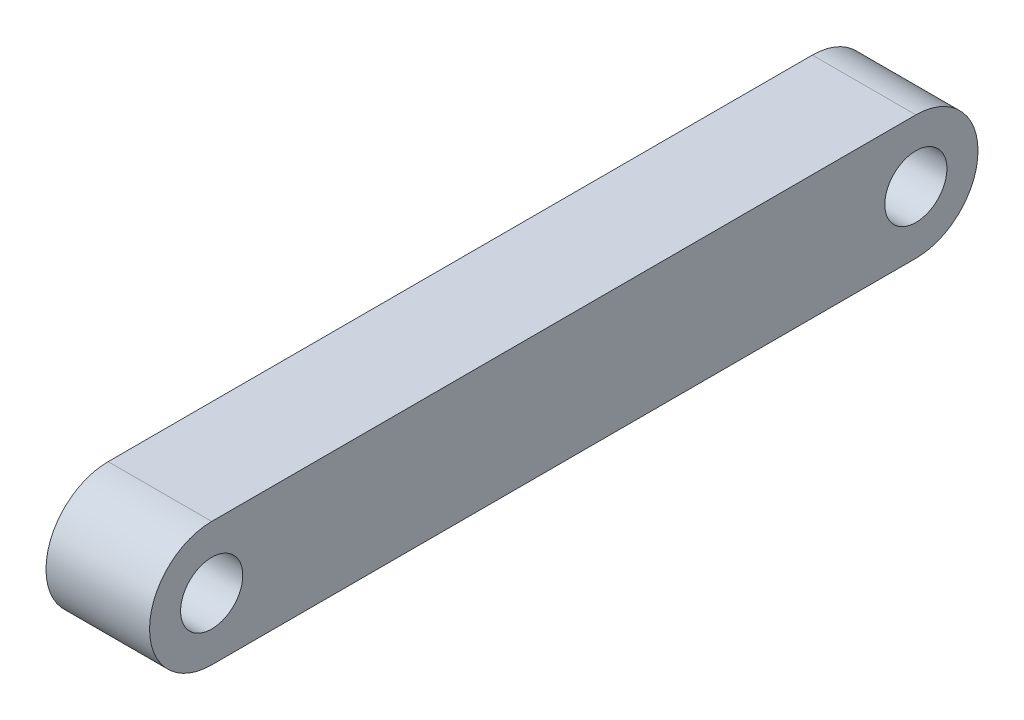
ISO-10303-21;
HEADER;
FILE_DESCRIPTION(('STEP AP214'),'2;1');
FILE_NAME('part.step','',(''),(''),'','','');
FILE_SCHEMA(('AUTOMOTIVE_DESIGN { 1 0 10303 214 1 1 1 1 }'));
ENDSEC;
DATA;
#1=APPLICATION_CONTEXT('core data for automotive mechanical design processes');
#2=APPLICATION_PROTOCOL_DEFINITION('international standard','automotive_design',2000,#1);
#3=PRODUCT_CONTEXT('',#1,'mechanical');
#4=PRODUCT('Part','Part','',(#3));
#5=PRODUCT_RELATED_PRODUCT_CATEGORY('part','',(#4));
#6=PRODUCT_DEFINITION_FORMATION('','',#4);
#7=PRODUCT_DEFINITION_CONTEXT('part definition',#1,'design');
#8=PRODUCT_DEFINITION('design','',#6,#7);
#9=PRODUCT_DEFINITION_SHAPE('','',#8);
#10=(LENGTH_UNIT() NAMED_UNIT(*) SI_UNIT(.MILLI.,.METRE.));
#11=(NAMED_UNIT(*) PLANE_ANGLE_UNIT() SI_UNIT($,.RADIAN.));
#12=(NAMED_UNIT(*) SI_UNIT($,.STERADIAN.) SOLID_ANGLE_UNIT());
#13=UNCERTAINTY_MEASURE_WITH_UNIT(LENGTH_MEASURE(1.E-05),#10,'distance_accuracy_value','');
#14=(GEOMETRIC_REPRESENTATION_CONTEXT(3) GLOBAL_UNCERTAINTY_ASSIGNED_CONTEXT((#13)) GLOBAL_UNIT_ASSIGNED_CONTEXT((#10,
#11,#12)) REPRESENTATION_CONTEXT('',''));
#15=CARTESIAN_POINT('',(0.,0.,0.));
#16=DIRECTION('',(0.,0.,1.));
#17=DIRECTION('',(1.,0.,0.));
#18=AXIS2_PLACEMENT_3D('',#15,#16,#17);
#19=CARTESIAN_POINT('',(2.5,0.,17.));
#20=DIRECTION('',(1.,0.,0.));
#21=DIRECTION('',(0.,0.,-1.));
#22=AXIS2_PLACEMENT_3D('',#19,#20,#21);
#23=PLANE('',#22);
#24=CARTESIAN_POINT('',(2.5,0.,-17.));
#25=DIRECTION('',(1.,0.,0.));
#26=DIRECTION('',(0.,0.,-1.));
#27=AXIS2_PLACEMENT_3D('',#24,#25,#26);
#28=CIRCLE('',#27,1.5);
#29=CARTESIAN_POINT('',(2.5,0.,-18.5));
#30=VERTEX_POINT('',#29);
#31=EDGE_CURVE('E106',#30,#30,#28,.T.);
#32=ORIENTED_EDGE('',*,*,#31,.F.);
#33=EDGE_LOOP('',(#32));
#34=FACE_BOUND('',#33,.T.);
#35=CARTESIAN_POINT('',(2.5,0.,17.));
#36=DIRECTION('',(1.,0.,0.));
#37=DIRECTION('',(0.,0.,-1.));
#38=AXIS2_PLACEMENT_3D('',#35,#36,#37);
#39=CIRCLE('',#38,3.00000000000001);
#40=CARTESIAN_POINT('',(2.5,3.00000000000001,17.));
#41=VERTEX_POINT('',#40);
#42=CARTESIAN_POINT('',(2.5,-3.00000000000001,17.));
#43=VERTEX_POINT('',#42);
#44=EDGE_CURVE('E91',#41,#43,#39,.T.);
#45=ORIENTED_EDGE('',*,*,#44,.T.);
#46=DIRECTION('',(0.,0.,-1.));
#47=VECTOR('',#46,1.);
#48=CARTESIAN_POINT('',(2.5,-3.00000000000001,17.));
#49=LINE('',#48,#47);
#50=CARTESIAN_POINT('',(2.5,-3.00000000000001,-17.));
#51=VERTEX_POINT('',#50);
#52=EDGE_CURVE('E86',#43,#51,#49,.T.);
#53=ORIENTED_EDGE('',*,*,#52,.T.);
#54=CARTESIAN_POINT('',(2.5,0.,-17.));
#55=DIRECTION('',(1.,0.,0.));
#56=DIRECTION('',(0.,0.,-1.));
#57=AXIS2_PLACEMENT_3D('',#54,#55,#56);
#58=CIRCLE('',#57,3.00000000000001);
#59=CARTESIAN_POINT('',(2.5,3.00000000000001,-17.));
#60=VERTEX_POINT('',#59);
#61=EDGE_CURVE('E89',#51,#60,#58,.T.);
#62=ORIENTED_EDGE('',*,*,#61,.T.);
#63=DIRECTION('',(0.,0.,1.));
#64=VECTOR('',#63,1.);
#65=CARTESIAN_POINT('',(2.5,3.00000000000001,17.));
#66=LINE('',#65,#64);
#67=EDGE_CURVE('E56',#60,#41,#66,.T.);
#68=ORIENTED_EDGE('',*,*,#67,.T.);
#69=EDGE_LOOP('',(#45,#53,#62,#68));
#70=FACE_BOUND('',#69,.T.);
#71=CARTESIAN_POINT('',(2.5,0.,17.));
#72=DIRECTION('',(1.,0.,0.));
#73=DIRECTION('',(0.,0.,-1.));
#74=AXIS2_PLACEMENT_3D('',#71,#72,#73);
#75=CIRCLE('',#74,1.5);
#76=CARTESIAN_POINT('',(2.5,0.,15.5));
#77=VERTEX_POINT('',#76);
#78=EDGE_CURVE('E121',#77,#77,#75,.T.);
#79=ORIENTED_EDGE('',*,*,#78,.F.);
#80=EDGE_LOOP('',(#79));
#81=FACE_BOUND('',#80,.T.);
#82=ADVANCED_FACE('F39',(#34,#70,#81),#23,.T.);
#83=CARTESIAN_POINT('',(-2.5,0.,17.));
#84=DIRECTION('',(1.,0.,0.));
#85=DIRECTION('',(0.,0.,-1.));
#86=AXIS2_PLACEMENT_3D('',#83,#84,#85);
#87=PLANE('',#86);
#88=CARTESIAN_POINT('',(-2.5,0.,17.));
#89=DIRECTION('',(1.,0.,0.));
#90=DIRECTION('',(0.,0.,-1.));
#91=AXIS2_PLACEMENT_3D('',#88,#89,#90);
#92=CIRCLE('',#91,3.00000000000001);
#93=CARTESIAN_POINT('',(-2.5,3.00000000000001,17.));
#94=VERTEX_POINT('',#93);
#95=CARTESIAN_POINT('',(-2.5,-3.00000000000001,17.));
#96=VERTEX_POINT('',#95);
#97=EDGE_CURVE('E103',#94,#96,#92,.T.);
#98=ORIENTED_EDGE('',*,*,#97,.F.);
#99=DIRECTION('',(0.,0.,1.));
#100=VECTOR('',#99,1.);
#101=CARTESIAN_POINT('',(-2.5,3.00000000000001,17.));
#102=LINE('',#101,#100);
#103=CARTESIAN_POINT('',(-2.5,3.00000000000001,-17.));
#104=VERTEX_POINT('',#103);
#105=EDGE_CURVE('E79',#104,#94,#102,.T.);
#106=ORIENTED_EDGE('',*,*,#105,.F.);
#107=CARTESIAN_POINT('',(-2.5,0.,-17.));
#108=DIRECTION('',(1.,0.,0.));
#109=DIRECTION('',(0.,0.,-1.));
#110=AXIS2_PLACEMENT_3D('',#107,#108,#109);
#111=CIRCLE('',#110,3.00000000000001);
#112=CARTESIAN_POINT('',(-2.5,-3.00000000000001,-17.));
#113=VERTEX_POINT('',#112);
#114=EDGE_CURVE('E73',#113,#104,#111,.T.);
#115=ORIENTED_EDGE('',*,*,#114,.F.);
#116=DIRECTION('',(0.,0.,-1.));
#117=VECTOR('',#116,1.);
#118=CARTESIAN_POINT('',(-2.5,-3.00000000000001,17.));
#119=LINE('',#118,#117);
#120=EDGE_CURVE('E95',#96,#113,#119,.T.);
#121=ORIENTED_EDGE('',*,*,#120,.F.);
#122=EDGE_LOOP('',(#98,#106,#115,#121));
#123=FACE_BOUND('',#122,.T.);
#124=CARTESIAN_POINT('',(-2.5,0.,-17.));
#125=DIRECTION('',(1.,0.,0.));
#126=DIRECTION('',(0.,0.,-1.));
#127=AXIS2_PLACEMENT_3D('',#124,#125,#126);
#128=CIRCLE('',#127,1.5);
#129=CARTESIAN_POINT('',(-2.5,0.,-18.5));
#130=VERTEX_POINT('',#129);
#131=EDGE_CURVE('E118',#130,#130,#128,.T.);
#132=ORIENTED_EDGE('',*,*,#131,.T.);
#133=EDGE_LOOP('',(#132));
#134=FACE_BOUND('',#133,.T.);
#135=CARTESIAN_POINT('',(-2.5,0.,17.));
#136=DIRECTION('',(1.,0.,0.));
#137=DIRECTION('',(0.,0.,-1.));
#138=AXIS2_PLACEMENT_3D('',#135,#136,#137);
#139=CIRCLE('',#138,1.5);
#140=CARTESIAN_POINT('',(-2.5,0.,15.5));
#141=VERTEX_POINT('',#140);
#142=EDGE_CURVE('E124',#141,#141,#139,.T.);
#143=ORIENTED_EDGE('',*,*,#142,.T.);
#144=EDGE_LOOP('',(#143));
#145=FACE_BOUND('',#144,.T.);
#146=ADVANCED_FACE('F114',(#123,#134,#145),#87,.F.);
#147=CARTESIAN_POINT('',(2.5,0.,17.));
#148=DIRECTION('',(-1.,0.,0.));
#149=DIRECTION('',(0.,0.,1.));
#150=AXIS2_PLACEMENT_3D('',#147,#148,#149);
#151=CYLINDRICAL_SURFACE('',#150,3.00000000000001);
#152=ORIENTED_EDGE('',*,*,#97,.T.);
#153=DIRECTION('',(-1.,0.,0.));
#154=VECTOR('',#153,1.);
#155=CARTESIAN_POINT('',(2.5,-3.00000000000001,17.));
#156=LINE('',#155,#154);
#157=EDGE_CURVE('E11',#43,#96,#156,.T.);
#158=ORIENTED_EDGE('',*,*,#157,.F.);
#159=ORIENTED_EDGE('',*,*,#44,.F.);
#160=DIRECTION('',(-1.,0.,0.));
#161=VECTOR('',#160,1.);
#162=CARTESIAN_POINT('',(2.5,3.00000000000001,17.));
#163=LINE('',#162,#161);
#164=EDGE_CURVE('E99',#41,#94,#163,.T.);
#165=ORIENTED_EDGE('',*,*,#164,.T.);
#166=EDGE_LOOP('',(#152,#158,#159,#165));
#167=FACE_BOUND('',#166,.T.);
#168=ADVANCED_FACE('F41',(#167),#151,.T.);
#169=CARTESIAN_POINT('',(2.5,-3.00000000000001,17.));
#170=DIRECTION('',(0.,1.,0.));
#171=DIRECTION('',(0.,0.,1.));
#172=AXIS2_PLACEMENT_3D('',#169,#170,#171);
#173=PLANE('',#172);
#174=ORIENTED_EDGE('',*,*,#120,.T.);
#175=DIRECTION('',(-1.,0.,0.));
#176=VECTOR('',#175,1.);
#177=CARTESIAN_POINT('',(2.5,-3.00000000000001,-17.));
#178=LINE('',#177,#176);
#179=EDGE_CURVE('E48',#51,#113,#178,.T.);
#180=ORIENTED_EDGE('',*,*,#179,.F.);
#181=ORIENTED_EDGE('',*,*,#52,.F.);
#182=ORIENTED_EDGE('',*,*,#157,.T.);
#183=EDGE_LOOP('',(#174,#180,#181,#182));
#184=FACE_BOUND('',#183,.T.);
#185=ADVANCED_FACE('F94',(#184),#173,.F.);
#186=CARTESIAN_POINT('',(2.5,0.,-17.));
#187=DIRECTION('',(-1.,0.,0.));
#188=DIRECTION('',(0.,0.,1.));
#189=AXIS2_PLACEMENT_3D('',#186,#187,#188);
#190=CYLINDRICAL_SURFACE('',#189,3.00000000000001);
#191=ORIENTED_EDGE('',*,*,#114,.T.);
#192=DIRECTION('',(-1.,0.,0.));
#193=VECTOR('',#192,1.);
#194=CARTESIAN_POINT('',(2.5,3.00000000000001,-17.));
#195=LINE('',#194,#193);
#196=EDGE_CURVE('E96',#60,#104,#195,.T.);
#197=ORIENTED_EDGE('',*,*,#196,.F.);
#198=ORIENTED_EDGE('',*,*,#61,.F.);
#199=ORIENTED_EDGE('',*,*,#179,.T.);
#200=EDGE_LOOP('',(#191,#197,#198,#199));
#201=FACE_BOUND('',#200,.T.);
#202=ADVANCED_FACE('F97',(#201),#190,.T.);
#203=CARTESIAN_POINT('',(2.5,3.00000000000001,17.));
#204=DIRECTION('',(0.,-1.,0.));
#205=DIRECTION('',(0.,0.,-1.));
#206=AXIS2_PLACEMENT_3D('',#203,#204,#205);
#207=PLANE('',#206);
#208=ORIENTED_EDGE('',*,*,#105,.T.);
#209=ORIENTED_EDGE('',*,*,#164,.F.);
#210=ORIENTED_EDGE('',*,*,#67,.F.);
#211=ORIENTED_EDGE('',*,*,#196,.T.);
#212=EDGE_LOOP('',(#208,#209,#210,#211));
#213=FACE_BOUND('',#212,.T.);
#214=ADVANCED_FACE('F111',(#213),#207,.F.);
#215=CARTESIAN_POINT('',(2.5,0.,-17.));
#216=DIRECTION('',(-1.,0.,0.));
#217=DIRECTION('',(0.,0.,1.));
#218=AXIS2_PLACEMENT_3D('',#215,#216,#217);
#219=CYLINDRICAL_SURFACE('',#218,1.5);
#220=ORIENTED_EDGE('',*,*,#31,.T.);
#221=EDGE_LOOP('',(#220));
#222=FACE_BOUND('',#221,.T.);
#223=ORIENTED_EDGE('',*,*,#131,.F.);
#224=EDGE_LOOP('',(#223));
#225=FACE_BOUND('',#224,.T.);
#226=ADVANCED_FACE('F141',(#222,#225),#219,.F.);
#227=CARTESIAN_POINT('',(2.5,0.,17.));
#228=DIRECTION('',(-1.,0.,0.));
#229=DIRECTION('',(0.,0.,1.));
#230=AXIS2_PLACEMENT_3D('',#227,#228,#229);
#231=CYLINDRICAL_SURFACE('',#230,1.5);
#232=ORIENTED_EDGE('',*,*,#78,.T.);
#233=EDGE_LOOP('',(#232));
#234=FACE_BOUND('',#233,.T.);
#235=ORIENTED_EDGE('',*,*,#142,.F.);
#236=EDGE_LOOP('',(#235));
#237=FACE_BOUND('',#236,.T.);
#238=ADVANCED_FACE('F130',(#234,#237),#231,.F.);
#239=CLOSED_SHELL('',(#82,#146,#168,#185,#202,#214,#226,#238));
#240=MANIFOLD_SOLID_BREP('B2',#239);
#241=ADVANCED_BREP_SHAPE_REPRESENTATION('',(#18,#240),#14);
#242=SHAPE_DEFINITION_REPRESENTATION(#9,#241);
ENDSEC;
END-ISO-10303-21;
